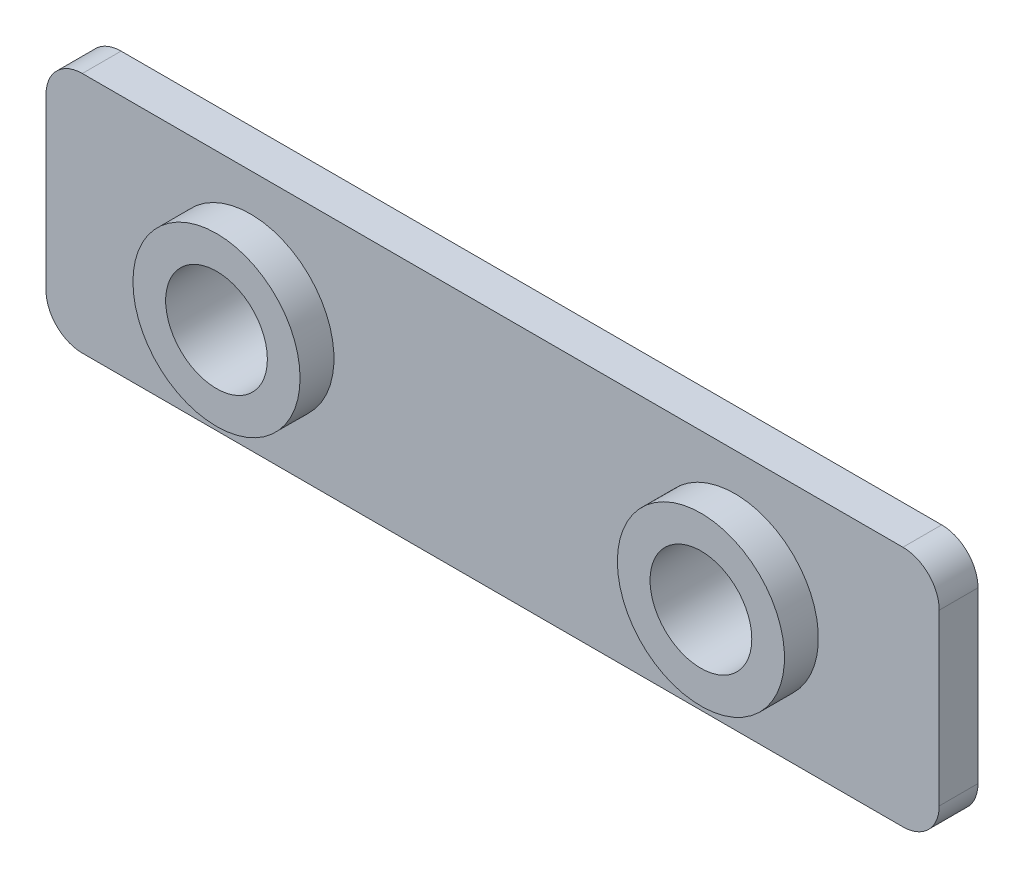
ISO-10303-21;
HEADER;
FILE_DESCRIPTION(('STEP AP214'),'2;1');
FILE_NAME('part.step','',(''),(''),'','','');
FILE_SCHEMA(('AUTOMOTIVE_DESIGN { 1 0 10303 214 1 1 1 1 }'));
ENDSEC;
DATA;
#1=APPLICATION_CONTEXT('core data for automotive mechanical design processes');
#2=APPLICATION_PROTOCOL_DEFINITION('international standard','automotive_design',2000,#1);
#3=PRODUCT_CONTEXT('',#1,'mechanical');
#4=PRODUCT('Part','Part','',(#3));
#5=PRODUCT_RELATED_PRODUCT_CATEGORY('part','',(#4));
#6=PRODUCT_DEFINITION_FORMATION('','',#4);
#7=PRODUCT_DEFINITION_CONTEXT('part definition',#1,'design');
#8=PRODUCT_DEFINITION('design','',#6,#7);
#9=PRODUCT_DEFINITION_SHAPE('','',#8);
#10=(LENGTH_UNIT() NAMED_UNIT(*) SI_UNIT(.MILLI.,.METRE.));
#11=(NAMED_UNIT(*) PLANE_ANGLE_UNIT() SI_UNIT($,.RADIAN.));
#12=(NAMED_UNIT(*) SI_UNIT($,.STERADIAN.) SOLID_ANGLE_UNIT());
#13=UNCERTAINTY_MEASURE_WITH_UNIT(LENGTH_MEASURE(1.E-05),#10,'distance_accuracy_value','');
#14=(GEOMETRIC_REPRESENTATION_CONTEXT(3) GLOBAL_UNCERTAINTY_ASSIGNED_CONTEXT((#13)) GLOBAL_UNIT_ASSIGNED_CONTEXT((#10,
#11,#12)) REPRESENTATION_CONTEXT('',''));
#15=CARTESIAN_POINT('',(0.,0.,0.));
#16=DIRECTION('',(0.,0.,1.));
#17=DIRECTION('',(1.,0.,0.));
#18=AXIS2_PLACEMENT_3D('',#15,#16,#17);
#19=CARTESIAN_POINT('',(35.38,8.5,1.6));
#20=DIRECTION('',(0.,0.,-1.));
#21=DIRECTION('',(-1.,0.,0.));
#22=AXIS2_PLACEMENT_3D('',#19,#20,#21);
#23=PLANE('',#22);
#24=CARTESIAN_POINT('',(8.44,5.,1.6));
#25=DIRECTION('',(0.,0.,-1.));
#26=DIRECTION('',(-1.,0.,0.));
#27=AXIS2_PLACEMENT_3D('',#24,#25,#26);
#28=CIRCLE('',#27,3.45);
#29=CARTESIAN_POINT('',(4.99,5.,1.6));
#30=VERTEX_POINT('',#29);
#31=EDGE_CURVE('E43',#30,#30,#28,.F.);
#32=ORIENTED_EDGE('',*,*,#31,.F.);
#33=EDGE_LOOP('',(#32));
#34=FACE_BOUND('',#33,.T.);
#35=CARTESIAN_POINT('',(35.38,8.5,1.6));
#36=DIRECTION('',(0.,0.,1.));
#37=DIRECTION('',(-1.,0.,0.));
#38=AXIS2_PLACEMENT_3D('',#35,#36,#37);
#39=CIRCLE('',#38,1.5);
#40=CARTESIAN_POINT('',(36.88,8.49999999999999,1.6));
#41=VERTEX_POINT('',#40);
#42=CARTESIAN_POINT('',(35.38,10.,1.6));
#43=VERTEX_POINT('',#42);
#44=EDGE_CURVE('E147',#41,#43,#39,.T.);
#45=ORIENTED_EDGE('',*,*,#44,.T.);
#46=DIRECTION('',(-1.,0.,0.));
#47=VECTOR('',#46,1.);
#48=CARTESIAN_POINT('',(1.50000000000001,10.,1.6));
#49=LINE('',#48,#47);
#50=CARTESIAN_POINT('',(1.50000000000001,10.,1.6));
#51=VERTEX_POINT('',#50);
#52=EDGE_CURVE('E95',#43,#51,#49,.T.);
#53=ORIENTED_EDGE('',*,*,#52,.T.);
#54=CARTESIAN_POINT('',(1.5,8.5,1.6));
#55=DIRECTION('',(0.,0.,1.));
#56=DIRECTION('',(-1.,0.,0.));
#57=AXIS2_PLACEMENT_3D('',#54,#55,#56);
#58=CIRCLE('',#57,1.5);
#59=CARTESIAN_POINT('',(0.,8.49999999999999,1.6));
#60=VERTEX_POINT('',#59);
#61=EDGE_CURVE('E207',#51,#60,#58,.T.);
#62=ORIENTED_EDGE('',*,*,#61,.T.);
#63=DIRECTION('',(0.,-1.,0.));
#64=VECTOR('',#63,1.);
#65=CARTESIAN_POINT('',(0.,1.50000000000001,1.6));
#66=LINE('',#65,#64);
#67=CARTESIAN_POINT('',(0.,1.50000000000001,1.6));
#68=VERTEX_POINT('',#67);
#69=EDGE_CURVE('E212',#60,#68,#66,.T.);
#70=ORIENTED_EDGE('',*,*,#69,.T.);
#71=CARTESIAN_POINT('',(1.5,1.5,1.6));
#72=DIRECTION('',(0.,0.,1.));
#73=DIRECTION('',(-1.,0.,0.));
#74=AXIS2_PLACEMENT_3D('',#71,#72,#73);
#75=CIRCLE('',#74,1.5);
#76=CARTESIAN_POINT('',(1.50000000000001,0.,1.6));
#77=VERTEX_POINT('',#76);
#78=EDGE_CURVE('E114',#68,#77,#75,.T.);
#79=ORIENTED_EDGE('',*,*,#78,.T.);
#80=DIRECTION('',(1.,0.,0.));
#81=VECTOR('',#80,1.);
#82=CARTESIAN_POINT('',(1.50000000000001,0.,1.6));
#83=LINE('',#82,#81);
#84=CARTESIAN_POINT('',(35.38,0.,1.6));
#85=VERTEX_POINT('',#84);
#86=EDGE_CURVE('E108',#77,#85,#83,.T.);
#87=ORIENTED_EDGE('',*,*,#86,.T.);
#88=CARTESIAN_POINT('',(35.38,1.5,1.6));
#89=DIRECTION('',(0.,0.,1.));
#90=DIRECTION('',(1.,0.,0.));
#91=AXIS2_PLACEMENT_3D('',#88,#89,#90);
#92=CIRCLE('',#91,1.5);
#93=CARTESIAN_POINT('',(36.88,1.50000000000001,1.6));
#94=VERTEX_POINT('',#93);
#95=EDGE_CURVE('E112',#85,#94,#92,.T.);
#96=ORIENTED_EDGE('',*,*,#95,.T.);
#97=DIRECTION('',(0.,1.,0.));
#98=VECTOR('',#97,1.);
#99=CARTESIAN_POINT('',(36.88,1.50000000000001,1.6));
#100=LINE('',#99,#98);
#101=EDGE_CURVE('E51',#94,#41,#100,.T.);
#102=ORIENTED_EDGE('',*,*,#101,.T.);
#103=EDGE_LOOP('',(#45,#53,#62,#70,#79,#87,#96,#102));
#104=FACE_BOUND('',#103,.T.);
#105=CARTESIAN_POINT('',(28.44,5.,1.6));
#106=DIRECTION('',(0.,0.,-1.));
#107=DIRECTION('',(-1.,0.,0.));
#108=AXIS2_PLACEMENT_3D('',#105,#106,#107);
#109=CIRCLE('',#108,3.45);
#110=CARTESIAN_POINT('',(24.99,5.,1.6));
#111=VERTEX_POINT('',#110);
#112=EDGE_CURVE('E11',#111,#111,#109,.F.);
#113=ORIENTED_EDGE('',*,*,#112,.F.);
#114=EDGE_LOOP('',(#113));
#115=FACE_BOUND('',#114,.T.);
#116=ADVANCED_FACE('F34',(#34,#104,#115),#23,.F.);
#117=CARTESIAN_POINT('',(35.38,8.5,1.6));
#118=DIRECTION('',(0.,0.,-1.));
#119=DIRECTION('',(-1.,0.,0.));
#120=AXIS2_PLACEMENT_3D('',#117,#118,#119);
#121=CYLINDRICAL_SURFACE('',#120,1.5);
#122=CARTESIAN_POINT('',(35.38,8.5,0.));
#123=DIRECTION('',(0.,0.,1.));
#124=DIRECTION('',(-1.,0.,0.));
#125=AXIS2_PLACEMENT_3D('',#122,#123,#124);
#126=CIRCLE('',#125,1.5);
#127=CARTESIAN_POINT('',(36.88,8.49999999999999,0.));
#128=VERTEX_POINT('',#127);
#129=CARTESIAN_POINT('',(35.38,10.,0.));
#130=VERTEX_POINT('',#129);
#131=EDGE_CURVE('E132',#128,#130,#126,.T.);
#132=ORIENTED_EDGE('',*,*,#131,.T.);
#133=DIRECTION('',(0.,0.,-1.));
#134=VECTOR('',#133,1.);
#135=CARTESIAN_POINT('',(35.38,10.,1.6));
#136=LINE('',#135,#134);
#137=EDGE_CURVE('E160',#43,#130,#136,.T.);
#138=ORIENTED_EDGE('',*,*,#137,.F.);
#139=ORIENTED_EDGE('',*,*,#44,.F.);
#140=DIRECTION('',(0.,0.,-1.));
#141=VECTOR('',#140,1.);
#142=CARTESIAN_POINT('',(36.88,8.49999999999999,1.6));
#143=LINE('',#142,#141);
#144=EDGE_CURVE('E128',#41,#128,#143,.T.);
#145=ORIENTED_EDGE('',*,*,#144,.T.);
#146=EDGE_LOOP('',(#132,#138,#139,#145));
#147=FACE_BOUND('',#146,.T.);
#148=ADVANCED_FACE('F36',(#147),#121,.T.);
#149=CARTESIAN_POINT('',(1.50000000000001,10.,1.6));
#150=DIRECTION('',(0.,-1.,0.));
#151=DIRECTION('',(0.,0.,-1.));
#152=AXIS2_PLACEMENT_3D('',#149,#150,#151);
#153=PLANE('',#152);
#154=DIRECTION('',(-1.,0.,0.));
#155=VECTOR('',#154,1.);
#156=CARTESIAN_POINT('',(1.50000000000001,10.,0.));
#157=LINE('',#156,#155);
#158=CARTESIAN_POINT('',(1.50000000000001,10.,0.));
#159=VERTEX_POINT('',#158);
#160=EDGE_CURVE('E135',#130,#159,#157,.T.);
#161=ORIENTED_EDGE('',*,*,#160,.T.);
#162=DIRECTION('',(0.,0.,-1.));
#163=VECTOR('',#162,1.);
#164=CARTESIAN_POINT('',(1.50000000000001,10.,1.6));
#165=LINE('',#164,#163);
#166=EDGE_CURVE('E157',#51,#159,#165,.T.);
#167=ORIENTED_EDGE('',*,*,#166,.F.);
#168=ORIENTED_EDGE('',*,*,#52,.F.);
#169=ORIENTED_EDGE('',*,*,#137,.T.);
#170=EDGE_LOOP('',(#161,#167,#168,#169));
#171=FACE_BOUND('',#170,.T.);
#172=ADVANCED_FACE('F171',(#171),#153,.F.);
#173=CARTESIAN_POINT('',(1.5,8.5,1.6));
#174=DIRECTION('',(0.,0.,-1.));
#175=DIRECTION('',(-1.,0.,0.));
#176=AXIS2_PLACEMENT_3D('',#173,#174,#175);
#177=CYLINDRICAL_SURFACE('',#176,1.5);
#178=CARTESIAN_POINT('',(1.5,8.5,0.));
#179=DIRECTION('',(0.,0.,1.));
#180=DIRECTION('',(-1.,0.,0.));
#181=AXIS2_PLACEMENT_3D('',#178,#179,#180);
#182=CIRCLE('',#181,1.5);
#183=CARTESIAN_POINT('',(0.,8.49999999999999,0.));
#184=VERTEX_POINT('',#183);
#185=EDGE_CURVE('E138',#159,#184,#182,.T.);
#186=ORIENTED_EDGE('',*,*,#185,.T.);
#187=DIRECTION('',(0.,0.,-1.));
#188=VECTOR('',#187,1.);
#189=CARTESIAN_POINT('',(0.,8.49999999999999,1.6));
#190=LINE('',#189,#188);
#191=EDGE_CURVE('E154',#60,#184,#190,.T.);
#192=ORIENTED_EDGE('',*,*,#191,.F.);
#193=ORIENTED_EDGE('',*,*,#61,.F.);
#194=ORIENTED_EDGE('',*,*,#166,.T.);
#195=EDGE_LOOP('',(#186,#192,#193,#194));
#196=FACE_BOUND('',#195,.T.);
#197=ADVANCED_FACE('F194',(#196),#177,.T.);
#198=CARTESIAN_POINT('',(0.,1.50000000000001,1.6));
#199=DIRECTION('',(1.,0.,0.));
#200=DIRECTION('',(0.,0.,-1.));
#201=AXIS2_PLACEMENT_3D('',#198,#199,#200);
#202=PLANE('',#201);
#203=DIRECTION('',(0.,-1.,0.));
#204=VECTOR('',#203,1.);
#205=CARTESIAN_POINT('',(0.,1.50000000000001,0.));
#206=LINE('',#205,#204);
#207=CARTESIAN_POINT('',(0.,1.50000000000001,0.));
#208=VERTEX_POINT('',#207);
#209=EDGE_CURVE('E140',#184,#208,#206,.T.);
#210=ORIENTED_EDGE('',*,*,#209,.T.);
#211=DIRECTION('',(0.,0.,-1.));
#212=VECTOR('',#211,1.);
#213=CARTESIAN_POINT('',(0.,1.50000000000001,1.6));
#214=LINE('',#213,#212);
#215=EDGE_CURVE('E151',#68,#208,#214,.T.);
#216=ORIENTED_EDGE('',*,*,#215,.F.);
#217=ORIENTED_EDGE('',*,*,#69,.F.);
#218=ORIENTED_EDGE('',*,*,#191,.T.);
#219=EDGE_LOOP('',(#210,#216,#217,#218));
#220=FACE_BOUND('',#219,.T.);
#221=ADVANCED_FACE('F190',(#220),#202,.F.);
#222=CARTESIAN_POINT('',(1.5,1.5,1.6));
#223=DIRECTION('',(0.,0.,-1.));
#224=DIRECTION('',(-1.,0.,0.));
#225=AXIS2_PLACEMENT_3D('',#222,#223,#224);
#226=CYLINDRICAL_SURFACE('',#225,1.5);
#227=CARTESIAN_POINT('',(1.5,1.5,0.));
#228=DIRECTION('',(0.,0.,1.));
#229=DIRECTION('',(-1.,0.,0.));
#230=AXIS2_PLACEMENT_3D('',#227,#228,#229);
#231=CIRCLE('',#230,1.5);
#232=CARTESIAN_POINT('',(1.50000000000001,0.,0.));
#233=VERTEX_POINT('',#232);
#234=EDGE_CURVE('E142',#208,#233,#231,.T.);
#235=ORIENTED_EDGE('',*,*,#234,.T.);
#236=DIRECTION('',(0.,0.,-1.));
#237=VECTOR('',#236,1.);
#238=CARTESIAN_POINT('',(1.50000000000001,0.,1.6));
#239=LINE('',#238,#237);
#240=EDGE_CURVE('E123',#77,#233,#239,.T.);
#241=ORIENTED_EDGE('',*,*,#240,.F.);
#242=ORIENTED_EDGE('',*,*,#78,.F.);
#243=ORIENTED_EDGE('',*,*,#215,.T.);
#244=EDGE_LOOP('',(#235,#241,#242,#243));
#245=FACE_BOUND('',#244,.T.);
#246=ADVANCED_FACE('F187',(#245),#226,.T.);
#247=CARTESIAN_POINT('',(1.50000000000001,0.,1.6));
#248=DIRECTION('',(0.,1.,0.));
#249=DIRECTION('',(0.,0.,1.));
#250=AXIS2_PLACEMENT_3D('',#247,#248,#249);
#251=PLANE('',#250);
#252=DIRECTION('',(1.,0.,0.));
#253=VECTOR('',#252,1.);
#254=CARTESIAN_POINT('',(1.50000000000001,0.,0.));
#255=LINE('',#254,#253);
#256=CARTESIAN_POINT('',(35.38,0.,0.));
#257=VERTEX_POINT('',#256);
#258=EDGE_CURVE('E122',#233,#257,#255,.T.);
#259=ORIENTED_EDGE('',*,*,#258,.T.);
#260=DIRECTION('',(0.,0.,-1.));
#261=VECTOR('',#260,1.);
#262=CARTESIAN_POINT('',(35.38,0.,1.6));
#263=LINE('',#262,#261);
#264=EDGE_CURVE('E119',#85,#257,#263,.T.);
#265=ORIENTED_EDGE('',*,*,#264,.F.);
#266=ORIENTED_EDGE('',*,*,#86,.F.);
#267=ORIENTED_EDGE('',*,*,#240,.T.);
#268=EDGE_LOOP('',(#259,#265,#266,#267));
#269=FACE_BOUND('',#268,.T.);
#270=ADVANCED_FACE('F120',(#269),#251,.F.);
#271=CARTESIAN_POINT('',(35.38,1.5,1.6));
#272=DIRECTION('',(0.,0.,-1.));
#273=DIRECTION('',(-1.,0.,0.));
#274=AXIS2_PLACEMENT_3D('',#271,#272,#273);
#275=CYLINDRICAL_SURFACE('',#274,1.5);
#276=CARTESIAN_POINT('',(35.38,1.5,0.));
#277=DIRECTION('',(0.,0.,1.));
#278=DIRECTION('',(1.,0.,0.));
#279=AXIS2_PLACEMENT_3D('',#276,#277,#278);
#280=CIRCLE('',#279,1.5);
#281=CARTESIAN_POINT('',(36.88,1.50000000000001,0.));
#282=VERTEX_POINT('',#281);
#283=EDGE_CURVE('E80',#257,#282,#280,.T.);
#284=ORIENTED_EDGE('',*,*,#283,.T.);
#285=DIRECTION('',(0.,0.,-1.));
#286=VECTOR('',#285,1.);
#287=CARTESIAN_POINT('',(36.88,1.50000000000001,1.6));
#288=LINE('',#287,#286);
#289=EDGE_CURVE('E124',#94,#282,#288,.T.);
#290=ORIENTED_EDGE('',*,*,#289,.F.);
#291=ORIENTED_EDGE('',*,*,#95,.F.);
#292=ORIENTED_EDGE('',*,*,#264,.T.);
#293=EDGE_LOOP('',(#284,#290,#291,#292));
#294=FACE_BOUND('',#293,.T.);
#295=ADVANCED_FACE('F126',(#294),#275,.T.);
#296=CARTESIAN_POINT('',(36.88,1.50000000000001,1.6));
#297=DIRECTION('',(-1.,0.,0.));
#298=DIRECTION('',(0.,0.,1.));
#299=AXIS2_PLACEMENT_3D('',#296,#297,#298);
#300=PLANE('',#299);
#301=DIRECTION('',(0.,1.,0.));
#302=VECTOR('',#301,1.);
#303=CARTESIAN_POINT('',(36.88,1.50000000000001,0.));
#304=LINE('',#303,#302);
#305=EDGE_CURVE('E86',#282,#128,#304,.T.);
#306=ORIENTED_EDGE('',*,*,#305,.T.);
#307=ORIENTED_EDGE('',*,*,#144,.F.);
#308=ORIENTED_EDGE('',*,*,#101,.F.);
#309=ORIENTED_EDGE('',*,*,#289,.T.);
#310=EDGE_LOOP('',(#306,#307,#308,#309));
#311=FACE_BOUND('',#310,.T.);
#312=ADVANCED_FACE('F179',(#311),#300,.F.);
#313=CARTESIAN_POINT('',(35.38,8.5,0.));
#314=DIRECTION('',(0.,0.,-1.));
#315=DIRECTION('',(-1.,0.,0.));
#316=AXIS2_PLACEMENT_3D('',#313,#314,#315);
#317=PLANE('',#316);
#318=CARTESIAN_POINT('',(8.44,5.,0.));
#319=DIRECTION('',(0.,0.,1.));
#320=DIRECTION('',(1.,0.,0.));
#321=AXIS2_PLACEMENT_3D('',#318,#319,#320);
#322=CIRCLE('',#321,2.1);
#323=CARTESIAN_POINT('',(10.54,5.,0.));
#324=VERTEX_POINT('',#323);
#325=EDGE_CURVE('E229',#324,#324,#322,.T.);
#326=ORIENTED_EDGE('',*,*,#325,.T.);
#327=EDGE_LOOP('',(#326));
#328=FACE_BOUND('',#327,.T.);
#329=CARTESIAN_POINT('',(28.44,5.,0.));
#330=DIRECTION('',(0.,0.,1.));
#331=DIRECTION('',(1.,0.,0.));
#332=AXIS2_PLACEMENT_3D('',#329,#330,#331);
#333=CIRCLE('',#332,2.1);
#334=CARTESIAN_POINT('',(30.54,5.,0.));
#335=VERTEX_POINT('',#334);
#336=EDGE_CURVE('E223',#335,#335,#333,.T.);
#337=ORIENTED_EDGE('',*,*,#336,.T.);
#338=EDGE_LOOP('',(#337));
#339=FACE_BOUND('',#338,.T.);
#340=ORIENTED_EDGE('',*,*,#131,.F.);
#341=ORIENTED_EDGE('',*,*,#305,.F.);
#342=ORIENTED_EDGE('',*,*,#283,.F.);
#343=ORIENTED_EDGE('',*,*,#258,.F.);
#344=ORIENTED_EDGE('',*,*,#234,.F.);
#345=ORIENTED_EDGE('',*,*,#209,.F.);
#346=ORIENTED_EDGE('',*,*,#185,.F.);
#347=ORIENTED_EDGE('',*,*,#160,.F.);
#348=EDGE_LOOP('',(#340,#341,#342,#343,#344,#345,#346,#347));
#349=FACE_BOUND('',#348,.T.);
#350=ADVANCED_FACE('F176',(#328,#339,#349),#317,.T.);
#351=CARTESIAN_POINT('',(8.44,5.,3.));
#352=DIRECTION('',(0.,0.,-1.));
#353=DIRECTION('',(-1.,0.,0.));
#354=AXIS2_PLACEMENT_3D('',#351,#352,#353);
#355=CYLINDRICAL_SURFACE('',#354,3.45);
#356=CARTESIAN_POINT('',(8.44,5.,3.));
#357=DIRECTION('',(0.,0.,1.));
#358=DIRECTION('',(1.,0.,0.));
#359=AXIS2_PLACEMENT_3D('',#356,#357,#358);
#360=CIRCLE('',#359,3.45);
#361=CARTESIAN_POINT('',(11.89,5.,3.));
#362=VERTEX_POINT('',#361);
#363=EDGE_CURVE('E136',#362,#362,#360,.T.);
#364=ORIENTED_EDGE('',*,*,#363,.F.);
#365=EDGE_LOOP('',(#364));
#366=FACE_BOUND('',#365,.T.);
#367=ORIENTED_EDGE('',*,*,#31,.T.);
#368=EDGE_LOOP('',(#367));
#369=FACE_BOUND('',#368,.T.);
#370=ADVANCED_FACE('F164',(#366,#369),#355,.T.);
#371=CARTESIAN_POINT('',(8.44,5.,3.));
#372=DIRECTION('',(0.,0.,1.));
#373=DIRECTION('',(1.,0.,0.));
#374=AXIS2_PLACEMENT_3D('',#371,#372,#373);
#375=PLANE('',#374);
#376=CARTESIAN_POINT('',(8.44,5.,3.));
#377=DIRECTION('',(0.,0.,1.));
#378=DIRECTION('',(1.,0.,0.));
#379=AXIS2_PLACEMENT_3D('',#376,#377,#378);
#380=CIRCLE('',#379,2.09999999999999);
#381=CARTESIAN_POINT('',(10.54,5.,3.));
#382=VERTEX_POINT('',#381);
#383=EDGE_CURVE('E232',#382,#382,#380,.T.);
#384=ORIENTED_EDGE('',*,*,#383,.F.);
#385=EDGE_LOOP('',(#384));
#386=FACE_BOUND('',#385,.T.);
#387=ORIENTED_EDGE('',*,*,#363,.T.);
#388=EDGE_LOOP('',(#387));
#389=FACE_BOUND('',#388,.T.);
#390=ADVANCED_FACE('F238',(#386,#389),#375,.T.);
#391=CARTESIAN_POINT('',(28.44,5.,3.));
#392=DIRECTION('',(0.,0.,-1.));
#393=DIRECTION('',(-1.,0.,0.));
#394=AXIS2_PLACEMENT_3D('',#391,#392,#393);
#395=CYLINDRICAL_SURFACE('',#394,3.45);
#396=CARTESIAN_POINT('',(28.44,5.,3.));
#397=DIRECTION('',(0.,0.,1.));
#398=DIRECTION('',(-1.,0.,0.));
#399=AXIS2_PLACEMENT_3D('',#396,#397,#398);
#400=CIRCLE('',#399,3.45);
#401=CARTESIAN_POINT('',(24.99,5.,3.));
#402=VERTEX_POINT('',#401);
#403=EDGE_CURVE('E220',#402,#402,#400,.T.);
#404=ORIENTED_EDGE('',*,*,#403,.F.);
#405=EDGE_LOOP('',(#404));
#406=FACE_BOUND('',#405,.T.);
#407=ORIENTED_EDGE('',*,*,#112,.T.);
#408=EDGE_LOOP('',(#407));
#409=FACE_BOUND('',#408,.T.);
#410=ADVANCED_FACE('F241',(#406,#409),#395,.T.);
#411=CARTESIAN_POINT('',(28.44,5.,3.));
#412=DIRECTION('',(0.,0.,-1.));
#413=DIRECTION('',(-1.,0.,0.));
#414=AXIS2_PLACEMENT_3D('',#411,#412,#413);
#415=PLANE('',#414);
#416=CARTESIAN_POINT('',(28.44,5.,3.));
#417=DIRECTION('',(0.,0.,1.));
#418=DIRECTION('',(1.,0.,0.));
#419=AXIS2_PLACEMENT_3D('',#416,#417,#418);
#420=CIRCLE('',#419,2.09999999999999);
#421=CARTESIAN_POINT('',(30.54,5.,3.));
#422=VERTEX_POINT('',#421);
#423=EDGE_CURVE('E226',#422,#422,#420,.T.);
#424=ORIENTED_EDGE('',*,*,#423,.F.);
#425=EDGE_LOOP('',(#424));
#426=FACE_BOUND('',#425,.T.);
#427=ORIENTED_EDGE('',*,*,#403,.T.);
#428=EDGE_LOOP('',(#427));
#429=FACE_BOUND('',#428,.T.);
#430=ADVANCED_FACE('F260',(#426,#429),#415,.F.);
#431=CARTESIAN_POINT('',(28.44,5.,3.));
#432=DIRECTION('',(0.,0.,1.));
#433=DIRECTION('',(1.,0.,0.));
#434=AXIS2_PLACEMENT_3D('',#431,#432,#433);
#435=CYLINDRICAL_SURFACE('',#434,2.09999999999999);
#436=ORIENTED_EDGE('',*,*,#336,.F.);
#437=EDGE_LOOP('',(#436));
#438=FACE_BOUND('',#437,.T.);
#439=ORIENTED_EDGE('',*,*,#423,.T.);
#440=EDGE_LOOP('',(#439));
#441=FACE_BOUND('',#440,.T.);
#442=ADVANCED_FACE('F267',(#438,#441),#435,.F.);
#443=CARTESIAN_POINT('',(8.44,5.,3.));
#444=DIRECTION('',(0.,0.,1.));
#445=DIRECTION('',(1.,0.,0.));
#446=AXIS2_PLACEMENT_3D('',#443,#444,#445);
#447=CYLINDRICAL_SURFACE('',#446,2.09999999999999);
#448=ORIENTED_EDGE('',*,*,#325,.F.);
#449=EDGE_LOOP('',(#448));
#450=FACE_BOUND('',#449,.T.);
#451=ORIENTED_EDGE('',*,*,#383,.T.);
#452=EDGE_LOOP('',(#451));
#453=FACE_BOUND('',#452,.T.);
#454=ADVANCED_FACE('F236',(#450,#453),#447,.F.);
#455=CLOSED_SHELL('',(#116,#148,#172,#197,#221,#246,#270,#295,#312,#350,#370,#390,#410,#430,
#442,#454));
#456=MANIFOLD_SOLID_BREP('B2',#455);
#457=ADVANCED_BREP_SHAPE_REPRESENTATION('',(#18,#456),#14);
#458=SHAPE_DEFINITION_REPRESENTATION(#9,#457);
ENDSEC;
END-ISO-10303-21;
